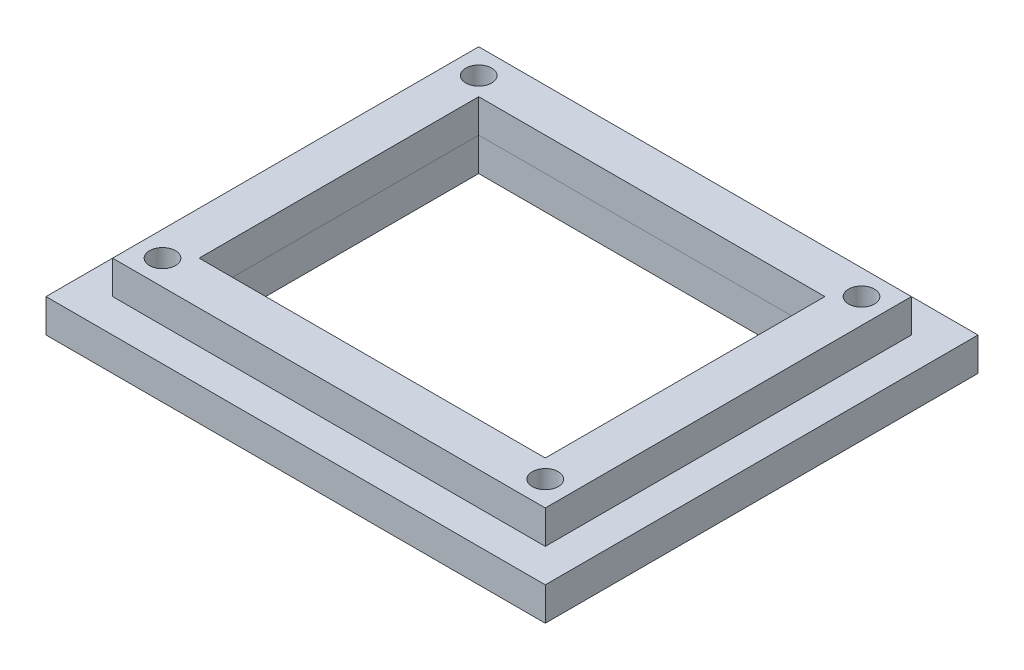
ISO-10303-21;
HEADER;
FILE_DESCRIPTION(('STEP AP214'),'2;1');
FILE_NAME('part.step','',(''),(''),'','','');
FILE_SCHEMA(('AUTOMOTIVE_DESIGN { 1 0 10303 214 1 1 1 1 }'));
ENDSEC;
DATA;
#1=APPLICATION_CONTEXT('core data for automotive mechanical design processes');
#2=APPLICATION_PROTOCOL_DEFINITION('international standard','automotive_design',2000,#1);
#3=PRODUCT_CONTEXT('',#1,'mechanical');
#4=PRODUCT('Part','Part','',(#3));
#5=PRODUCT_RELATED_PRODUCT_CATEGORY('part','',(#4));
#6=PRODUCT_DEFINITION_FORMATION('','',#4);
#7=PRODUCT_DEFINITION_CONTEXT('part definition',#1,'design');
#8=PRODUCT_DEFINITION('design','',#6,#7);
#9=PRODUCT_DEFINITION_SHAPE('','',#8);
#10=(LENGTH_UNIT() NAMED_UNIT(*) SI_UNIT(.MILLI.,.METRE.));
#11=(NAMED_UNIT(*) PLANE_ANGLE_UNIT() SI_UNIT($,.RADIAN.));
#12=(NAMED_UNIT(*) SI_UNIT($,.STERADIAN.) SOLID_ANGLE_UNIT());
#13=UNCERTAINTY_MEASURE_WITH_UNIT(LENGTH_MEASURE(1.E-05),#10,'distance_accuracy_value','');
#14=(GEOMETRIC_REPRESENTATION_CONTEXT(3) GLOBAL_UNCERTAINTY_ASSIGNED_CONTEXT((#13)) GLOBAL_UNIT_ASSIGNED_CONTEXT((#10,
#11,#12)) REPRESENTATION_CONTEXT('',''));
#15=CARTESIAN_POINT('',(0.,0.,0.));
#16=DIRECTION('',(0.,0.,1.));
#17=DIRECTION('',(1.,0.,0.));
#18=AXIS2_PLACEMENT_3D('',#15,#16,#17);
#19=CARTESIAN_POINT('',(26.,-5.,0.));
#20=DIRECTION('',(1.,0.,0.));
#21=DIRECTION('',(0.,0.,-1.));
#22=AXIS2_PLACEMENT_3D('',#19,#20,#21);
#23=PLANE('',#22);
#24=DIRECTION('',(0.,0.,-1.));
#25=VECTOR('',#24,1.);
#26=CARTESIAN_POINT('',(26.,0.,0.));
#27=LINE('',#26,#25);
#28=CARTESIAN_POINT('',(26.,0.,21.));
#29=VERTEX_POINT('',#28);
#30=CARTESIAN_POINT('',(26.,0.,-21.));
#31=VERTEX_POINT('',#30);
#32=EDGE_CURVE('E245',#29,#31,#27,.T.);
#33=ORIENTED_EDGE('',*,*,#32,.T.);
#34=DIRECTION('',(0.,1.,0.));
#35=VECTOR('',#34,1.);
#36=CARTESIAN_POINT('',(26.,-5.,-21.));
#37=LINE('',#36,#35);
#38=CARTESIAN_POINT('',(26.,-5.,-21.));
#39=VERTEX_POINT('',#38);
#40=EDGE_CURVE('E126',#39,#31,#37,.T.);
#41=ORIENTED_EDGE('',*,*,#40,.F.);
#42=DIRECTION('',(0.,0.,-1.));
#43=VECTOR('',#42,1.);
#44=CARTESIAN_POINT('',(26.,-5.,0.));
#45=LINE('',#44,#43);
#46=CARTESIAN_POINT('',(26.,-5.,21.));
#47=VERTEX_POINT('',#46);
#48=EDGE_CURVE('E196',#47,#39,#45,.T.);
#49=ORIENTED_EDGE('',*,*,#48,.F.);
#50=DIRECTION('',(0.,1.,0.));
#51=VECTOR('',#50,1.);
#52=CARTESIAN_POINT('',(26.,-5.,21.));
#53=LINE('',#52,#51);
#54=EDGE_CURVE('E13',#47,#29,#53,.T.);
#55=ORIENTED_EDGE('',*,*,#54,.T.);
#56=EDGE_LOOP('',(#33,#41,#49,#55));
#57=FACE_BOUND('',#56,.T.);
#58=ADVANCED_FACE('F115',(#57),#23,.F.);
#59=CARTESIAN_POINT('',(0.,-5.,-21.));
#60=DIRECTION('',(0.,0.,-1.));
#61=DIRECTION('',(-1.,0.,0.));
#62=AXIS2_PLACEMENT_3D('',#59,#60,#61);
#63=PLANE('',#62);
#64=DIRECTION('',(-1.,0.,0.));
#65=VECTOR('',#64,1.);
#66=CARTESIAN_POINT('',(0.,0.,-21.));
#67=LINE('',#66,#65);
#68=CARTESIAN_POINT('',(-26.,0.,-21.));
#69=VERTEX_POINT('',#68);
#70=EDGE_CURVE('E163',#31,#69,#67,.T.);
#71=ORIENTED_EDGE('',*,*,#70,.T.);
#72=DIRECTION('',(0.,1.,0.));
#73=VECTOR('',#72,1.);
#74=CARTESIAN_POINT('',(-26.,-5.,-21.));
#75=LINE('',#74,#73);
#76=CARTESIAN_POINT('',(-26.,-5.,-21.));
#77=VERTEX_POINT('',#76);
#78=EDGE_CURVE('E201',#77,#69,#75,.T.);
#79=ORIENTED_EDGE('',*,*,#78,.F.);
#80=DIRECTION('',(-1.,0.,0.));
#81=VECTOR('',#80,1.);
#82=CARTESIAN_POINT('',(0.,-5.,-21.));
#83=LINE('',#82,#81);
#84=EDGE_CURVE('E190',#39,#77,#83,.T.);
#85=ORIENTED_EDGE('',*,*,#84,.F.);
#86=ORIENTED_EDGE('',*,*,#40,.T.);
#87=EDGE_LOOP('',(#71,#79,#85,#86));
#88=FACE_BOUND('',#87,.T.);
#89=ADVANCED_FACE('F202',(#88),#63,.F.);
#90=CARTESIAN_POINT('',(-26.,-5.,0.));
#91=DIRECTION('',(1.,0.,0.));
#92=DIRECTION('',(0.,0.,-1.));
#93=AXIS2_PLACEMENT_3D('',#90,#91,#92);
#94=PLANE('',#93);
#95=DIRECTION('',(0.,0.,-1.));
#96=VECTOR('',#95,1.);
#97=CARTESIAN_POINT('',(-26.,0.,0.));
#98=LINE('',#97,#96);
#99=CARTESIAN_POINT('',(-26.,0.,21.));
#100=VERTEX_POINT('',#99);
#101=EDGE_CURVE('E240',#100,#69,#98,.T.);
#102=ORIENTED_EDGE('',*,*,#101,.F.);
#103=DIRECTION('',(0.,1.,0.));
#104=VECTOR('',#103,1.);
#105=CARTESIAN_POINT('',(-26.,-5.,21.));
#106=LINE('',#105,#104);
#107=CARTESIAN_POINT('',(-26.,-5.,21.));
#108=VERTEX_POINT('',#107);
#109=EDGE_CURVE('E206',#108,#100,#106,.T.);
#110=ORIENTED_EDGE('',*,*,#109,.F.);
#111=DIRECTION('',(0.,0.,-1.));
#112=VECTOR('',#111,1.);
#113=CARTESIAN_POINT('',(-26.,-5.,0.));
#114=LINE('',#113,#112);
#115=EDGE_CURVE('E195',#108,#77,#114,.T.);
#116=ORIENTED_EDGE('',*,*,#115,.T.);
#117=ORIENTED_EDGE('',*,*,#78,.T.);
#118=EDGE_LOOP('',(#102,#110,#116,#117));
#119=FACE_BOUND('',#118,.T.);
#120=ADVANCED_FACE('F208',(#119),#94,.T.);
#121=CARTESIAN_POINT('',(0.,-5.,21.));
#122=DIRECTION('',(0.,0.,-1.));
#123=DIRECTION('',(-1.,0.,0.));
#124=AXIS2_PLACEMENT_3D('',#121,#122,#123);
#125=PLANE('',#124);
#126=DIRECTION('',(-1.,0.,0.));
#127=VECTOR('',#126,1.);
#128=CARTESIAN_POINT('',(0.,0.,21.));
#129=LINE('',#128,#127);
#130=EDGE_CURVE('E236',#29,#100,#129,.T.);
#131=ORIENTED_EDGE('',*,*,#130,.F.);
#132=ORIENTED_EDGE('',*,*,#54,.F.);
#133=DIRECTION('',(-1.,0.,0.));
#134=VECTOR('',#133,1.);
#135=CARTESIAN_POINT('',(0.,-5.,21.));
#136=LINE('',#135,#134);
#137=EDGE_CURVE('E210',#47,#108,#136,.T.);
#138=ORIENTED_EDGE('',*,*,#137,.T.);
#139=ORIENTED_EDGE('',*,*,#109,.T.);
#140=EDGE_LOOP('',(#131,#132,#138,#139));
#141=FACE_BOUND('',#140,.T.);
#142=ADVANCED_FACE('F297',(#141),#125,.T.);
#143=CARTESIAN_POINT('',(-37.5,-5.,0.));
#144=DIRECTION('',(1.,0.,0.));
#145=DIRECTION('',(0.,0.,-1.));
#146=AXIS2_PLACEMENT_3D('',#143,#144,#145);
#147=PLANE('',#146);
#148=DIRECTION('',(0.,0.,-1.));
#149=VECTOR('',#148,1.);
#150=CARTESIAN_POINT('',(-37.5,0.,0.));
#151=LINE('',#150,#149);
#152=CARTESIAN_POINT('',(-37.5,0.,32.5));
#153=VERTEX_POINT('',#152);
#154=CARTESIAN_POINT('',(-37.5,0.,-32.5));
#155=VERTEX_POINT('',#154);
#156=EDGE_CURVE('E232',#153,#155,#151,.T.);
#157=ORIENTED_EDGE('',*,*,#156,.T.);
#158=DIRECTION('',(0.,1.,0.));
#159=VECTOR('',#158,1.);
#160=CARTESIAN_POINT('',(-37.5,-5.,-32.5));
#161=LINE('',#160,#159);
#162=CARTESIAN_POINT('',(-37.5,-5.,-32.5));
#163=VERTEX_POINT('',#162);
#164=EDGE_CURVE('E256',#163,#155,#161,.T.);
#165=ORIENTED_EDGE('',*,*,#164,.F.);
#166=DIRECTION('',(0.,0.,-1.));
#167=VECTOR('',#166,1.);
#168=CARTESIAN_POINT('',(-37.5,-5.,0.));
#169=LINE('',#168,#167);
#170=CARTESIAN_POINT('',(-37.5,-5.,32.5));
#171=VERTEX_POINT('',#170);
#172=EDGE_CURVE('E213',#171,#163,#169,.T.);
#173=ORIENTED_EDGE('',*,*,#172,.F.);
#174=DIRECTION('',(0.,1.,0.));
#175=VECTOR('',#174,1.);
#176=CARTESIAN_POINT('',(-37.5,-5.,32.5));
#177=LINE('',#176,#175);
#178=EDGE_CURVE('E253',#171,#153,#177,.T.);
#179=ORIENTED_EDGE('',*,*,#178,.T.);
#180=EDGE_LOOP('',(#157,#165,#173,#179));
#181=FACE_BOUND('',#180,.T.);
#182=ADVANCED_FACE('F273',(#181),#147,.F.);
#183=CARTESIAN_POINT('',(0.,-5.,-32.5));
#184=DIRECTION('',(0.,0.,1.));
#185=DIRECTION('',(1.,0.,0.));
#186=AXIS2_PLACEMENT_3D('',#183,#184,#185);
#187=PLANE('',#186);
#188=DIRECTION('',(1.,0.,0.));
#189=VECTOR('',#188,1.);
#190=CARTESIAN_POINT('',(0.,0.,-32.5));
#191=LINE('',#190,#189);
#192=CARTESIAN_POINT('',(37.5,0.,-32.5));
#193=VERTEX_POINT('',#192);
#194=EDGE_CURVE('E228',#155,#193,#191,.T.);
#195=ORIENTED_EDGE('',*,*,#194,.T.);
#196=DIRECTION('',(0.,1.,0.));
#197=VECTOR('',#196,1.);
#198=CARTESIAN_POINT('',(37.5,-5.,-32.5));
#199=LINE('',#198,#197);
#200=CARTESIAN_POINT('',(37.5,-5.,-32.5));
#201=VERTEX_POINT('',#200);
#202=EDGE_CURVE('E259',#201,#193,#199,.T.);
#203=ORIENTED_EDGE('',*,*,#202,.F.);
#204=DIRECTION('',(1.,0.,0.));
#205=VECTOR('',#204,1.);
#206=CARTESIAN_POINT('',(0.,-5.,-32.5));
#207=LINE('',#206,#205);
#208=EDGE_CURVE('E278',#163,#201,#207,.T.);
#209=ORIENTED_EDGE('',*,*,#208,.F.);
#210=ORIENTED_EDGE('',*,*,#164,.T.);
#211=EDGE_LOOP('',(#195,#203,#209,#210));
#212=FACE_BOUND('',#211,.T.);
#213=ADVANCED_FACE('F290',(#212),#187,.F.);
#214=CARTESIAN_POINT('',(37.5,-5.,0.));
#215=DIRECTION('',(1.,0.,0.));
#216=DIRECTION('',(0.,0.,-1.));
#217=AXIS2_PLACEMENT_3D('',#214,#215,#216);
#218=PLANE('',#217);
#219=DIRECTION('',(0.,0.,-1.));
#220=VECTOR('',#219,1.);
#221=CARTESIAN_POINT('',(37.5,0.,0.));
#222=LINE('',#221,#220);
#223=CARTESIAN_POINT('',(37.5,0.,32.5));
#224=VERTEX_POINT('',#223);
#225=EDGE_CURVE('E223',#224,#193,#222,.T.);
#226=ORIENTED_EDGE('',*,*,#225,.F.);
#227=DIRECTION('',(0.,1.,0.));
#228=VECTOR('',#227,1.);
#229=CARTESIAN_POINT('',(37.5,-5.,32.5));
#230=LINE('',#229,#228);
#231=CARTESIAN_POINT('',(37.5,-5.,32.5));
#232=VERTEX_POINT('',#231);
#233=EDGE_CURVE('E119',#232,#224,#230,.T.);
#234=ORIENTED_EDGE('',*,*,#233,.F.);
#235=DIRECTION('',(0.,0.,-1.));
#236=VECTOR('',#235,1.);
#237=CARTESIAN_POINT('',(37.5,-5.,0.));
#238=LINE('',#237,#236);
#239=EDGE_CURVE('E279',#232,#201,#238,.T.);
#240=ORIENTED_EDGE('',*,*,#239,.T.);
#241=ORIENTED_EDGE('',*,*,#202,.T.);
#242=EDGE_LOOP('',(#226,#234,#240,#241));
#243=FACE_BOUND('',#242,.T.);
#244=ADVANCED_FACE('F267',(#243),#218,.T.);
#245=CARTESIAN_POINT('',(0.,-5.,32.5));
#246=DIRECTION('',(0.,0.,1.));
#247=DIRECTION('',(1.,0.,0.));
#248=AXIS2_PLACEMENT_3D('',#245,#246,#247);
#249=PLANE('',#248);
#250=DIRECTION('',(1.,0.,0.));
#251=VECTOR('',#250,1.);
#252=CARTESIAN_POINT('',(0.,0.,32.5));
#253=LINE('',#252,#251);
#254=EDGE_CURVE('E219',#153,#224,#253,.T.);
#255=ORIENTED_EDGE('',*,*,#254,.F.);
#256=ORIENTED_EDGE('',*,*,#178,.F.);
#257=DIRECTION('',(1.,0.,0.));
#258=VECTOR('',#257,1.);
#259=CARTESIAN_POINT('',(0.,-5.,32.5));
#260=LINE('',#259,#258);
#261=EDGE_CURVE('E247',#171,#232,#260,.T.);
#262=ORIENTED_EDGE('',*,*,#261,.T.);
#263=ORIENTED_EDGE('',*,*,#233,.T.);
#264=EDGE_LOOP('',(#255,#256,#262,#263));
#265=FACE_BOUND('',#264,.T.);
#266=ADVANCED_FACE('F117',(#265),#249,.T.);
#267=CARTESIAN_POINT('',(0.,0.,0.));
#268=DIRECTION('',(0.,1.,0.));
#269=DIRECTION('',(0.,0.,1.));
#270=AXIS2_PLACEMENT_3D('',#267,#268,#269);
#271=PLANE('',#270);
#272=CARTESIAN_POINT('',(-30.,0.,25.));
#273=DIRECTION('',(0.,-1.,0.));
#274=DIRECTION('',(0.,0.,-1.));
#275=AXIS2_PLACEMENT_3D('',#272,#273,#274);
#276=CIRCLE('',#275,1.95);
#277=CARTESIAN_POINT('',(-30.,0.,23.05));
#278=VERTEX_POINT('',#277);
#279=EDGE_CURVE('E224',#278,#278,#276,.T.);
#280=ORIENTED_EDGE('',*,*,#279,.T.);
#281=EDGE_LOOP('',(#280));
#282=FACE_BOUND('',#281,.T.);
#283=CARTESIAN_POINT('',(-30.,0.,-25.));
#284=DIRECTION('',(0.,-1.,0.));
#285=DIRECTION('',(0.,0.,-1.));
#286=AXIS2_PLACEMENT_3D('',#283,#284,#285);
#287=CIRCLE('',#286,1.95);
#288=CARTESIAN_POINT('',(-30.,0.,-26.95));
#289=VERTEX_POINT('',#288);
#290=EDGE_CURVE('E327',#289,#289,#287,.T.);
#291=ORIENTED_EDGE('',*,*,#290,.T.);
#292=EDGE_LOOP('',(#291));
#293=FACE_BOUND('',#292,.T.);
#294=CARTESIAN_POINT('',(30.,0.,-25.));
#295=DIRECTION('',(0.,-1.,0.));
#296=DIRECTION('',(0.,0.,-1.));
#297=AXIS2_PLACEMENT_3D('',#294,#295,#296);
#298=CIRCLE('',#297,1.95);
#299=CARTESIAN_POINT('',(30.,0.,-26.95));
#300=VERTEX_POINT('',#299);
#301=EDGE_CURVE('E331',#300,#300,#298,.T.);
#302=ORIENTED_EDGE('',*,*,#301,.T.);
#303=EDGE_LOOP('',(#302));
#304=FACE_BOUND('',#303,.T.);
#305=CARTESIAN_POINT('',(30.,0.,25.));
#306=DIRECTION('',(0.,-1.,0.));
#307=DIRECTION('',(0.,0.,-1.));
#308=AXIS2_PLACEMENT_3D('',#305,#306,#307);
#309=CIRCLE('',#308,1.95);
#310=CARTESIAN_POINT('',(30.,0.,23.05));
#311=VERTEX_POINT('',#310);
#312=EDGE_CURVE('E285',#311,#311,#309,.T.);
#313=ORIENTED_EDGE('',*,*,#312,.T.);
#314=EDGE_LOOP('',(#313));
#315=FACE_BOUND('',#314,.T.);
#316=ORIENTED_EDGE('',*,*,#254,.T.);
#317=ORIENTED_EDGE('',*,*,#225,.T.);
#318=ORIENTED_EDGE('',*,*,#194,.F.);
#319=ORIENTED_EDGE('',*,*,#156,.F.);
#320=EDGE_LOOP('',(#316,#317,#318,#319));
#321=FACE_BOUND('',#320,.T.);
#322=ORIENTED_EDGE('',*,*,#130,.T.);
#323=ORIENTED_EDGE('',*,*,#101,.T.);
#324=ORIENTED_EDGE('',*,*,#70,.F.);
#325=ORIENTED_EDGE('',*,*,#32,.F.);
#326=EDGE_LOOP('',(#322,#323,#324,#325));
#327=FACE_BOUND('',#326,.T.);
#328=ADVANCED_FACE('F270',(#282,#293,#304,#315,#321,#327),#271,.T.);
#329=CARTESIAN_POINT('',(0.,-5.,0.));
#330=DIRECTION('',(0.,1.,0.));
#331=DIRECTION('',(0.,0.,1.));
#332=AXIS2_PLACEMENT_3D('',#329,#330,#331);
#333=PLANE('',#332);
#334=CARTESIAN_POINT('',(-30.,-5.,25.));
#335=DIRECTION('',(0.,-1.,0.));
#336=DIRECTION('',(0.,0.,-1.));
#337=AXIS2_PLACEMENT_3D('',#334,#335,#336);
#338=CIRCLE('',#337,1.95);
#339=CARTESIAN_POINT('',(-30.,-5.,23.05));
#340=VERTEX_POINT('',#339);
#341=EDGE_CURVE('E354',#340,#340,#338,.T.);
#342=ORIENTED_EDGE('',*,*,#341,.F.);
#343=EDGE_LOOP('',(#342));
#344=FACE_BOUND('',#343,.T.);
#345=CARTESIAN_POINT('',(-30.,-5.,-25.));
#346=DIRECTION('',(0.,-1.,0.));
#347=DIRECTION('',(0.,0.,-1.));
#348=AXIS2_PLACEMENT_3D('',#345,#346,#347);
#349=CIRCLE('',#348,1.95);
#350=CARTESIAN_POINT('',(-30.,-5.,-26.95));
#351=VERTEX_POINT('',#350);
#352=EDGE_CURVE('E350',#351,#351,#349,.T.);
#353=ORIENTED_EDGE('',*,*,#352,.F.);
#354=EDGE_LOOP('',(#353));
#355=FACE_BOUND('',#354,.T.);
#356=CARTESIAN_POINT('',(30.,-5.,-25.));
#357=DIRECTION('',(0.,-1.,0.));
#358=DIRECTION('',(0.,0.,-1.));
#359=AXIS2_PLACEMENT_3D('',#356,#357,#358);
#360=CIRCLE('',#359,1.95);
#361=CARTESIAN_POINT('',(30.,-5.,-26.95));
#362=VERTEX_POINT('',#361);
#363=EDGE_CURVE('E342',#362,#362,#360,.T.);
#364=ORIENTED_EDGE('',*,*,#363,.F.);
#365=EDGE_LOOP('',(#364));
#366=FACE_BOUND('',#365,.T.);
#367=CARTESIAN_POINT('',(30.,-5.,25.));
#368=DIRECTION('',(0.,-1.,0.));
#369=DIRECTION('',(0.,0.,-1.));
#370=AXIS2_PLACEMENT_3D('',#367,#368,#369);
#371=CIRCLE('',#370,1.95);
#372=CARTESIAN_POINT('',(30.,-5.,23.05));
#373=VERTEX_POINT('',#372);
#374=EDGE_CURVE('E336',#373,#373,#371,.T.);
#375=ORIENTED_EDGE('',*,*,#374,.F.);
#376=EDGE_LOOP('',(#375));
#377=FACE_BOUND('',#376,.T.);
#378=ORIENTED_EDGE('',*,*,#261,.F.);
#379=ORIENTED_EDGE('',*,*,#172,.T.);
#380=ORIENTED_EDGE('',*,*,#208,.T.);
#381=ORIENTED_EDGE('',*,*,#239,.F.);
#382=EDGE_LOOP('',(#378,#379,#380,#381));
#383=FACE_BOUND('',#382,.T.);
#384=ORIENTED_EDGE('',*,*,#137,.F.);
#385=ORIENTED_EDGE('',*,*,#48,.T.);
#386=ORIENTED_EDGE('',*,*,#84,.T.);
#387=ORIENTED_EDGE('',*,*,#115,.F.);
#388=EDGE_LOOP('',(#384,#385,#386,#387));
#389=FACE_BOUND('',#388,.T.);
#390=ADVANCED_FACE('F193',(#344,#355,#366,#377,#383,#389),#333,.F.);
#391=CARTESIAN_POINT('',(30.,0.,25.));
#392=DIRECTION('',(0.,-1.,0.));
#393=DIRECTION('',(0.,0.,-1.));
#394=AXIS2_PLACEMENT_3D('',#391,#392,#393);
#395=CYLINDRICAL_SURFACE('',#394,1.95);
#396=ORIENTED_EDGE('',*,*,#312,.F.);
#397=EDGE_LOOP('',(#396));
#398=FACE_BOUND('',#397,.T.);
#399=ORIENTED_EDGE('',*,*,#374,.T.);
#400=EDGE_LOOP('',(#399));
#401=FACE_BOUND('',#400,.T.);
#402=ADVANCED_FACE('F319',(#398,#401),#395,.F.);
#403=CARTESIAN_POINT('',(30.,0.,-25.));
#404=DIRECTION('',(0.,-1.,0.));
#405=DIRECTION('',(0.,0.,-1.));
#406=AXIS2_PLACEMENT_3D('',#403,#404,#405);
#407=CYLINDRICAL_SURFACE('',#406,1.95);
#408=ORIENTED_EDGE('',*,*,#301,.F.);
#409=EDGE_LOOP('',(#408));
#410=FACE_BOUND('',#409,.T.);
#411=ORIENTED_EDGE('',*,*,#363,.T.);
#412=EDGE_LOOP('',(#411));
#413=FACE_BOUND('',#412,.T.);
#414=ADVANCED_FACE('F368',(#410,#413),#407,.F.);
#415=CARTESIAN_POINT('',(-30.,0.,-25.));
#416=DIRECTION('',(0.,-1.,0.));
#417=DIRECTION('',(0.,0.,-1.));
#418=AXIS2_PLACEMENT_3D('',#415,#416,#417);
#419=CYLINDRICAL_SURFACE('',#418,1.95);
#420=ORIENTED_EDGE('',*,*,#290,.F.);
#421=EDGE_LOOP('',(#420));
#422=FACE_BOUND('',#421,.T.);
#423=ORIENTED_EDGE('',*,*,#352,.T.);
#424=EDGE_LOOP('',(#423));
#425=FACE_BOUND('',#424,.T.);
#426=ADVANCED_FACE('F370',(#422,#425),#419,.F.);
#427=CARTESIAN_POINT('',(-30.,0.,25.));
#428=DIRECTION('',(0.,-1.,0.));
#429=DIRECTION('',(0.,0.,-1.));
#430=AXIS2_PLACEMENT_3D('',#427,#428,#429);
#431=CYLINDRICAL_SURFACE('',#430,1.95);
#432=ORIENTED_EDGE('',*,*,#279,.F.);
#433=EDGE_LOOP('',(#432));
#434=FACE_BOUND('',#433,.T.);
#435=ORIENTED_EDGE('',*,*,#341,.T.);
#436=EDGE_LOOP('',(#435));
#437=FACE_BOUND('',#436,.T.);
#438=ADVANCED_FACE('F361',(#434,#437),#431,.F.);
#439=CLOSED_SHELL('',(#58,#89,#120,#142,#182,#213,#244,#266,#328,#390,#402,#414,#426,#438));
#440=MANIFOLD_SOLID_BREP('B2',#439);
#441=CARTESIAN_POINT('',(0.,5.,21.));
#442=DIRECTION('',(0.,0.,1.));
#443=DIRECTION('',(1.,0.,0.));
#444=AXIS2_PLACEMENT_3D('',#441,#442,#443);
#445=PLANE('',#444);
#446=DIRECTION('',(-1.,0.,0.));
#447=VECTOR('',#446,1.);
#448=CARTESIAN_POINT('',(0.,0.,21.));
#449=LINE('',#448,#447);
#450=CARTESIAN_POINT('',(26.,0.,21.));
#451=VERTEX_POINT('',#450);
#452=CARTESIAN_POINT('',(-26.,0.,21.));
#453=VERTEX_POINT('',#452);
#454=EDGE_CURVE('E644',#451,#453,#449,.T.);
#455=ORIENTED_EDGE('',*,*,#454,.T.);
#456=DIRECTION('',(0.,-1.,0.));
#457=VECTOR('',#456,1.);
#458=CARTESIAN_POINT('',(-26.,5.,21.));
#459=LINE('',#458,#457);
#460=CARTESIAN_POINT('',(-26.,5.,21.));
#461=VERTEX_POINT('',#460);
#462=EDGE_CURVE('E113',#461,#453,#459,.T.);
#463=ORIENTED_EDGE('',*,*,#462,.F.);
#464=DIRECTION('',(-1.,0.,0.));
#465=VECTOR('',#464,1.);
#466=CARTESIAN_POINT('',(0.,5.,21.));
#467=LINE('',#466,#465);
#468=CARTESIAN_POINT('',(26.,5.,21.));
#469=VERTEX_POINT('',#468);
#470=EDGE_CURVE('E603',#469,#461,#467,.T.);
#471=ORIENTED_EDGE('',*,*,#470,.F.);
#472=DIRECTION('',(0.,-1.,0.));
#473=VECTOR('',#472,1.);
#474=CARTESIAN_POINT('',(26.,5.,21.));
#475=LINE('',#474,#473);
#476=EDGE_CURVE('E543',#469,#451,#475,.T.);
#477=ORIENTED_EDGE('',*,*,#476,.T.);
#478=EDGE_LOOP('',(#455,#463,#471,#477));
#479=FACE_BOUND('',#478,.T.);
#480=ADVANCED_FACE('F524',(#479),#445,.F.);
#481=CARTESIAN_POINT('',(-26.,5.,0.));
#482=DIRECTION('',(-1.,0.,0.));
#483=DIRECTION('',(0.,0.,1.));
#484=AXIS2_PLACEMENT_3D('',#481,#482,#483);
#485=PLANE('',#484);
#486=DIRECTION('',(0.,0.,-1.));
#487=VECTOR('',#486,1.);
#488=CARTESIAN_POINT('',(-26.,0.,0.));
#489=LINE('',#488,#487);
#490=CARTESIAN_POINT('',(-26.,0.,-21.));
#491=VERTEX_POINT('',#490);
#492=EDGE_CURVE('E609',#453,#491,#489,.T.);
#493=ORIENTED_EDGE('',*,*,#492,.T.);
#494=DIRECTION('',(0.,-1.,0.));
#495=VECTOR('',#494,1.);
#496=CARTESIAN_POINT('',(-26.,5.,-21.));
#497=LINE('',#496,#495);
#498=CARTESIAN_POINT('',(-26.,5.,-21.));
#499=VERTEX_POINT('',#498);
#500=EDGE_CURVE('E534',#499,#491,#497,.T.);
#501=ORIENTED_EDGE('',*,*,#500,.F.);
#502=DIRECTION('',(0.,0.,-1.));
#503=VECTOR('',#502,1.);
#504=CARTESIAN_POINT('',(-26.,5.,0.));
#505=LINE('',#504,#503);
#506=EDGE_CURVE('E597',#461,#499,#505,.T.);
#507=ORIENTED_EDGE('',*,*,#506,.F.);
#508=ORIENTED_EDGE('',*,*,#462,.T.);
#509=EDGE_LOOP('',(#493,#501,#507,#508));
#510=FACE_BOUND('',#509,.T.);
#511=ADVANCED_FACE('F608',(#510),#485,.F.);
#512=CARTESIAN_POINT('',(0.,5.,-21.));
#513=DIRECTION('',(0.,0.,1.));
#514=DIRECTION('',(1.,0.,0.));
#515=AXIS2_PLACEMENT_3D('',#512,#513,#514);
#516=PLANE('',#515);
#517=DIRECTION('',(-1.,0.,0.));
#518=VECTOR('',#517,1.);
#519=CARTESIAN_POINT('',(0.,0.,-21.));
#520=LINE('',#519,#518);
#521=CARTESIAN_POINT('',(26.,0.,-21.));
#522=VERTEX_POINT('',#521);
#523=EDGE_CURVE('E647',#522,#491,#520,.T.);
#524=ORIENTED_EDGE('',*,*,#523,.F.);
#525=DIRECTION('',(0.,-1.,0.));
#526=VECTOR('',#525,1.);
#527=CARTESIAN_POINT('',(26.,5.,-21.));
#528=LINE('',#527,#526);
#529=CARTESIAN_POINT('',(26.,5.,-21.));
#530=VERTEX_POINT('',#529);
#531=EDGE_CURVE('E569',#530,#522,#528,.T.);
#532=ORIENTED_EDGE('',*,*,#531,.F.);
#533=DIRECTION('',(-1.,0.,0.));
#534=VECTOR('',#533,1.);
#535=CARTESIAN_POINT('',(0.,5.,-21.));
#536=LINE('',#535,#534);
#537=EDGE_CURVE('E602',#530,#499,#536,.T.);
#538=ORIENTED_EDGE('',*,*,#537,.T.);
#539=ORIENTED_EDGE('',*,*,#500,.T.);
#540=EDGE_LOOP('',(#524,#532,#538,#539));
#541=FACE_BOUND('',#540,.T.);
#542=ADVANCED_FACE('F613',(#541),#516,.T.);
#543=CARTESIAN_POINT('',(32.5,5.,0.));
#544=DIRECTION('',(1.,0.,0.));
#545=DIRECTION('',(0.,0.,-1.));
#546=AXIS2_PLACEMENT_3D('',#543,#544,#545);
#547=PLANE('',#546);
#548=DIRECTION('',(0.,0.,1.));
#549=VECTOR('',#548,1.);
#550=CARTESIAN_POINT('',(32.5,0.,0.));
#551=LINE('',#550,#549);
#552=CARTESIAN_POINT('',(32.5,0.,-27.5));
#553=VERTEX_POINT('',#552);
#554=CARTESIAN_POINT('',(32.5,0.,27.5));
#555=VERTEX_POINT('',#554);
#556=EDGE_CURVE('E632',#553,#555,#551,.T.);
#557=ORIENTED_EDGE('',*,*,#556,.F.);
#558=DIRECTION('',(0.,-1.,0.));
#559=VECTOR('',#558,1.);
#560=CARTESIAN_POINT('',(32.5,5.,-27.5));
#561=LINE('',#560,#559);
#562=CARTESIAN_POINT('',(32.5,5.,-27.5));
#563=VERTEX_POINT('',#562);
#564=EDGE_CURVE('E528',#563,#553,#561,.T.);
#565=ORIENTED_EDGE('',*,*,#564,.F.);
#566=DIRECTION('',(0.,0.,1.));
#567=VECTOR('',#566,1.);
#568=CARTESIAN_POINT('',(32.5,5.,0.));
#569=LINE('',#568,#567);
#570=CARTESIAN_POINT('',(32.5,5.,27.5));
#571=VERTEX_POINT('',#570);
#572=EDGE_CURVE('E683',#563,#571,#569,.T.);
#573=ORIENTED_EDGE('',*,*,#572,.T.);
#574=DIRECTION('',(0.,-1.,0.));
#575=VECTOR('',#574,1.);
#576=CARTESIAN_POINT('',(32.5,5.,27.5));
#577=LINE('',#576,#575);
#578=EDGE_CURVE('E616',#571,#555,#577,.T.);
#579=ORIENTED_EDGE('',*,*,#578,.T.);
#580=EDGE_LOOP('',(#557,#565,#573,#579));
#581=FACE_BOUND('',#580,.T.);
#582=ADVANCED_FACE('F668',(#581),#547,.T.);
#583=CARTESIAN_POINT('',(0.,5.,-27.5));
#584=DIRECTION('',(0.,0.,-1.));
#585=DIRECTION('',(-1.,0.,0.));
#586=AXIS2_PLACEMENT_3D('',#583,#584,#585);
#587=PLANE('',#586);
#588=DIRECTION('',(1.,0.,0.));
#589=VECTOR('',#588,1.);
#590=CARTESIAN_POINT('',(0.,0.,-27.5));
#591=LINE('',#590,#589);
#592=CARTESIAN_POINT('',(-32.5,0.,-27.5));
#593=VERTEX_POINT('',#592);
#594=EDGE_CURVE('E635',#593,#553,#591,.T.);
#595=ORIENTED_EDGE('',*,*,#594,.F.);
#596=DIRECTION('',(0.,-1.,0.));
#597=VECTOR('',#596,1.);
#598=CARTESIAN_POINT('',(-32.5,5.,-27.5));
#599=LINE('',#598,#597);
#600=CARTESIAN_POINT('',(-32.5,5.,-27.5));
#601=VERTEX_POINT('',#600);
#602=EDGE_CURVE('E658',#601,#593,#599,.T.);
#603=ORIENTED_EDGE('',*,*,#602,.F.);
#604=DIRECTION('',(1.,0.,0.));
#605=VECTOR('',#604,1.);
#606=CARTESIAN_POINT('',(0.,5.,-27.5));
#607=LINE('',#606,#605);
#608=EDGE_CURVE('E667',#601,#563,#607,.T.);
#609=ORIENTED_EDGE('',*,*,#608,.T.);
#610=ORIENTED_EDGE('',*,*,#564,.T.);
#611=EDGE_LOOP('',(#595,#603,#609,#610));
#612=FACE_BOUND('',#611,.T.);
#613=ADVANCED_FACE('F665',(#612),#587,.T.);
#614=CARTESIAN_POINT('',(-32.5,5.,0.));
#615=DIRECTION('',(1.,0.,0.));
#616=DIRECTION('',(0.,0.,-1.));
#617=AXIS2_PLACEMENT_3D('',#614,#615,#616);
#618=PLANE('',#617);
#619=DIRECTION('',(0.,0.,1.));
#620=VECTOR('',#619,1.);
#621=CARTESIAN_POINT('',(-32.5,0.,0.));
#622=LINE('',#621,#620);
#623=CARTESIAN_POINT('',(-32.5,0.,27.5));
#624=VERTEX_POINT('',#623);
#625=EDGE_CURVE('E638',#593,#624,#622,.T.);
#626=ORIENTED_EDGE('',*,*,#625,.T.);
#627=DIRECTION('',(0.,-1.,0.));
#628=VECTOR('',#627,1.);
#629=CARTESIAN_POINT('',(-32.5,5.,27.5));
#630=LINE('',#629,#628);
#631=CARTESIAN_POINT('',(-32.5,5.,27.5));
#632=VERTEX_POINT('',#631);
#633=EDGE_CURVE('E656',#632,#624,#630,.T.);
#634=ORIENTED_EDGE('',*,*,#633,.F.);
#635=DIRECTION('',(0.,0.,1.));
#636=VECTOR('',#635,1.);
#637=CARTESIAN_POINT('',(-32.5,5.,0.));
#638=LINE('',#637,#636);
#639=EDGE_CURVE('E676',#601,#632,#638,.T.);
#640=ORIENTED_EDGE('',*,*,#639,.F.);
#641=ORIENTED_EDGE('',*,*,#602,.T.);
#642=EDGE_LOOP('',(#626,#634,#640,#641));
#643=FACE_BOUND('',#642,.T.);
#644=ADVANCED_FACE('F674',(#643),#618,.F.);
#645=CARTESIAN_POINT('',(0.,5.,27.5));
#646=DIRECTION('',(0.,0.,-1.));
#647=DIRECTION('',(-1.,0.,0.));
#648=AXIS2_PLACEMENT_3D('',#645,#646,#647);
#649=PLANE('',#648);
#650=DIRECTION('',(1.,0.,0.));
#651=VECTOR('',#650,1.);
#652=CARTESIAN_POINT('',(0.,0.,27.5));
#653=LINE('',#652,#651);
#654=EDGE_CURVE('E641',#624,#555,#653,.T.);
#655=ORIENTED_EDGE('',*,*,#654,.T.);
#656=ORIENTED_EDGE('',*,*,#578,.F.);
#657=DIRECTION('',(1.,0.,0.));
#658=VECTOR('',#657,1.);
#659=CARTESIAN_POINT('',(0.,5.,27.5));
#660=LINE('',#659,#658);
#661=EDGE_CURVE('E679',#632,#571,#660,.T.);
#662=ORIENTED_EDGE('',*,*,#661,.F.);
#663=ORIENTED_EDGE('',*,*,#633,.T.);
#664=EDGE_LOOP('',(#655,#656,#662,#663));
#665=FACE_BOUND('',#664,.T.);
#666=ADVANCED_FACE('F678',(#665),#649,.F.);
#667=CARTESIAN_POINT('',(-28.75,5.,23.75));
#668=DIRECTION('',(0.,-1.,0.));
#669=DIRECTION('',(0.,0.,-1.));
#670=AXIS2_PLACEMENT_3D('',#667,#668,#669);
#671=CYLINDRICAL_SURFACE('',#670,1.95);
#672=CARTESIAN_POINT('',(-28.75,5.,23.75));
#673=DIRECTION('',(0.,1.,0.));
#674=DIRECTION('',(0.,0.,1.));
#675=AXIS2_PLACEMENT_3D('',#672,#673,#674);
#676=CIRCLE('',#675,1.95);
#677=CARTESIAN_POINT('',(-28.75,5.,25.7));
#678=VERTEX_POINT('',#677);
#679=EDGE_CURVE('E687',#678,#678,#676,.T.);
#680=ORIENTED_EDGE('',*,*,#679,.T.);
#681=EDGE_LOOP('',(#680));
#682=FACE_BOUND('',#681,.T.);
#683=CARTESIAN_POINT('',(-28.75,0.,23.75));
#684=DIRECTION('',(0.,1.,0.));
#685=DIRECTION('',(0.,0.,1.));
#686=AXIS2_PLACEMENT_3D('',#683,#684,#685);
#687=CIRCLE('',#686,1.95);
#688=CARTESIAN_POINT('',(-28.75,0.,25.7));
#689=VERTEX_POINT('',#688);
#690=EDGE_CURVE('E629',#689,#689,#687,.T.);
#691=ORIENTED_EDGE('',*,*,#690,.F.);
#692=EDGE_LOOP('',(#691));
#693=FACE_BOUND('',#692,.T.);
#694=ADVANCED_FACE('F711',(#682,#693),#671,.F.);
#695=CARTESIAN_POINT('',(28.75,5.,-23.75));
#696=DIRECTION('',(0.,-1.,0.));
#697=DIRECTION('',(0.,0.,-1.));
#698=AXIS2_PLACEMENT_3D('',#695,#696,#697);
#699=CYLINDRICAL_SURFACE('',#698,1.95);
#700=CARTESIAN_POINT('',(28.75,5.,-23.75));
#701=DIRECTION('',(0.,1.,0.));
#702=DIRECTION('',(0.,0.,1.));
#703=AXIS2_PLACEMENT_3D('',#700,#701,#702);
#704=CIRCLE('',#703,1.95);
#705=CARTESIAN_POINT('',(28.75,5.,-21.8));
#706=VERTEX_POINT('',#705);
#707=EDGE_CURVE('E690',#706,#706,#704,.T.);
#708=ORIENTED_EDGE('',*,*,#707,.T.);
#709=EDGE_LOOP('',(#708));
#710=FACE_BOUND('',#709,.T.);
#711=CARTESIAN_POINT('',(28.75,0.,-23.75));
#712=DIRECTION('',(0.,1.,0.));
#713=DIRECTION('',(0.,0.,1.));
#714=AXIS2_PLACEMENT_3D('',#711,#712,#713);
#715=CIRCLE('',#714,1.95);
#716=CARTESIAN_POINT('',(28.75,0.,-21.8));
#717=VERTEX_POINT('',#716);
#718=EDGE_CURVE('E626',#717,#717,#715,.T.);
#719=ORIENTED_EDGE('',*,*,#718,.F.);
#720=EDGE_LOOP('',(#719));
#721=FACE_BOUND('',#720,.T.);
#722=ADVANCED_FACE('F714',(#710,#721),#699,.F.);
#723=CARTESIAN_POINT('',(-28.75,5.,-23.75));
#724=DIRECTION('',(0.,-1.,0.));
#725=DIRECTION('',(0.,0.,-1.));
#726=AXIS2_PLACEMENT_3D('',#723,#724,#725);
#727=CYLINDRICAL_SURFACE('',#726,1.95);
#728=CARTESIAN_POINT('',(-28.75,5.,-23.75));
#729=DIRECTION('',(0.,1.,0.));
#730=DIRECTION('',(0.,0.,1.));
#731=AXIS2_PLACEMENT_3D('',#728,#729,#730);
#732=CIRCLE('',#731,1.95);
#733=CARTESIAN_POINT('',(-28.75,5.,-21.8));
#734=VERTEX_POINT('',#733);
#735=EDGE_CURVE('E693',#734,#734,#732,.T.);
#736=ORIENTED_EDGE('',*,*,#735,.T.);
#737=EDGE_LOOP('',(#736));
#738=FACE_BOUND('',#737,.T.);
#739=CARTESIAN_POINT('',(-28.75,0.,-23.75));
#740=DIRECTION('',(0.,1.,0.));
#741=DIRECTION('',(0.,0.,1.));
#742=AXIS2_PLACEMENT_3D('',#739,#740,#741);
#743=CIRCLE('',#742,1.95);
#744=CARTESIAN_POINT('',(-28.75,0.,-21.8));
#745=VERTEX_POINT('',#744);
#746=EDGE_CURVE('E623',#745,#745,#743,.T.);
#747=ORIENTED_EDGE('',*,*,#746,.F.);
#748=EDGE_LOOP('',(#747));
#749=FACE_BOUND('',#748,.T.);
#750=ADVANCED_FACE('F727',(#738,#749),#727,.F.);
#751=CARTESIAN_POINT('',(28.75,5.,23.75));
#752=DIRECTION('',(0.,-1.,0.));
#753=DIRECTION('',(0.,0.,-1.));
#754=AXIS2_PLACEMENT_3D('',#751,#752,#753);
#755=CYLINDRICAL_SURFACE('',#754,1.95);
#756=CARTESIAN_POINT('',(28.75,5.,23.75));
#757=DIRECTION('',(0.,1.,0.));
#758=DIRECTION('',(0.,0.,1.));
#759=AXIS2_PLACEMENT_3D('',#756,#757,#758);
#760=CIRCLE('',#759,1.95);
#761=CARTESIAN_POINT('',(28.75,5.,25.7));
#762=VERTEX_POINT('',#761);
#763=EDGE_CURVE('E652',#762,#762,#760,.T.);
#764=ORIENTED_EDGE('',*,*,#763,.T.);
#765=EDGE_LOOP('',(#764));
#766=FACE_BOUND('',#765,.T.);
#767=CARTESIAN_POINT('',(28.75,0.,23.75));
#768=DIRECTION('',(0.,1.,0.));
#769=DIRECTION('',(0.,0.,1.));
#770=AXIS2_PLACEMENT_3D('',#767,#768,#769);
#771=CIRCLE('',#770,1.95);
#772=CARTESIAN_POINT('',(28.75,0.,25.7));
#773=VERTEX_POINT('',#772);
#774=EDGE_CURVE('E620',#773,#773,#771,.T.);
#775=ORIENTED_EDGE('',*,*,#774,.F.);
#776=EDGE_LOOP('',(#775));
#777=FACE_BOUND('',#776,.T.);
#778=ADVANCED_FACE('F526',(#766,#777),#755,.F.);
#779=CARTESIAN_POINT('',(26.,5.,0.));
#780=DIRECTION('',(-1.,0.,0.));
#781=DIRECTION('',(0.,0.,1.));
#782=AXIS2_PLACEMENT_3D('',#779,#780,#781);
#783=PLANE('',#782);
#784=DIRECTION('',(0.,0.,-1.));
#785=VECTOR('',#784,1.);
#786=CARTESIAN_POINT('',(26.,0.,0.));
#787=LINE('',#786,#785);
#788=EDGE_CURVE('E649',#451,#522,#787,.T.);
#789=ORIENTED_EDGE('',*,*,#788,.F.);
#790=ORIENTED_EDGE('',*,*,#476,.F.);
#791=DIRECTION('',(0.,0.,-1.));
#792=VECTOR('',#791,1.);
#793=CARTESIAN_POINT('',(26.,5.,0.));
#794=LINE('',#793,#792);
#795=EDGE_CURVE('E614',#469,#530,#794,.T.);
#796=ORIENTED_EDGE('',*,*,#795,.T.);
#797=ORIENTED_EDGE('',*,*,#531,.T.);
#798=EDGE_LOOP('',(#789,#790,#796,#797));
#799=FACE_BOUND('',#798,.T.);
#800=ADVANCED_FACE('F703',(#799),#783,.T.);
#801=CARTESIAN_POINT('',(0.,5.,0.));
#802=DIRECTION('',(0.,1.,0.));
#803=DIRECTION('',(0.,0.,1.));
#804=AXIS2_PLACEMENT_3D('',#801,#802,#803);
#805=PLANE('',#804);
#806=ORIENTED_EDGE('',*,*,#763,.F.);
#807=EDGE_LOOP('',(#806));
#808=FACE_BOUND('',#807,.T.);
#809=ORIENTED_EDGE('',*,*,#735,.F.);
#810=EDGE_LOOP('',(#809));
#811=FACE_BOUND('',#810,.T.);
#812=ORIENTED_EDGE('',*,*,#707,.F.);
#813=EDGE_LOOP('',(#812));
#814=FACE_BOUND('',#813,.T.);
#815=ORIENTED_EDGE('',*,*,#679,.F.);
#816=EDGE_LOOP('',(#815));
#817=FACE_BOUND('',#816,.T.);
#818=ORIENTED_EDGE('',*,*,#572,.F.);
#819=ORIENTED_EDGE('',*,*,#608,.F.);
#820=ORIENTED_EDGE('',*,*,#639,.T.);
#821=ORIENTED_EDGE('',*,*,#661,.T.);
#822=EDGE_LOOP('',(#818,#819,#820,#821));
#823=FACE_BOUND('',#822,.T.);
#824=ORIENTED_EDGE('',*,*,#470,.T.);
#825=ORIENTED_EDGE('',*,*,#506,.T.);
#826=ORIENTED_EDGE('',*,*,#537,.F.);
#827=ORIENTED_EDGE('',*,*,#795,.F.);
#828=EDGE_LOOP('',(#824,#825,#826,#827));
#829=FACE_BOUND('',#828,.T.);
#830=ADVANCED_FACE('F599',(#808,#811,#814,#817,#823,#829),#805,.T.);
#831=CARTESIAN_POINT('',(0.,0.,0.));
#832=DIRECTION('',(0.,1.,0.));
#833=DIRECTION('',(0.,0.,1.));
#834=AXIS2_PLACEMENT_3D('',#831,#832,#833);
#835=PLANE('',#834);
#836=ORIENTED_EDGE('',*,*,#690,.T.);
#837=EDGE_LOOP('',(#836));
#838=FACE_BOUND('',#837,.T.);
#839=ORIENTED_EDGE('',*,*,#746,.T.);
#840=EDGE_LOOP('',(#839));
#841=FACE_BOUND('',#840,.T.);
#842=ORIENTED_EDGE('',*,*,#718,.T.);
#843=EDGE_LOOP('',(#842));
#844=FACE_BOUND('',#843,.T.);
#845=ORIENTED_EDGE('',*,*,#774,.T.);
#846=EDGE_LOOP('',(#845));
#847=FACE_BOUND('',#846,.T.);
#848=ORIENTED_EDGE('',*,*,#556,.T.);
#849=ORIENTED_EDGE('',*,*,#654,.F.);
#850=ORIENTED_EDGE('',*,*,#625,.F.);
#851=ORIENTED_EDGE('',*,*,#594,.T.);
#852=EDGE_LOOP('',(#848,#849,#850,#851));
#853=FACE_BOUND('',#852,.T.);
#854=ORIENTED_EDGE('',*,*,#454,.F.);
#855=ORIENTED_EDGE('',*,*,#788,.T.);
#856=ORIENTED_EDGE('',*,*,#523,.T.);
#857=ORIENTED_EDGE('',*,*,#492,.F.);
#858=EDGE_LOOP('',(#854,#855,#856,#857));
#859=FACE_BOUND('',#858,.T.);
#860=ADVANCED_FACE('F671',(#838,#841,#844,#847,#853,#859),#835,.F.);
#861=CLOSED_SHELL('',(#480,#511,#542,#582,#613,#644,#666,#694,#722,#750,#778,#800,#830,#860));
#862=MANIFOLD_SOLID_BREP('B7',#861);
#863=ADVANCED_BREP_SHAPE_REPRESENTATION('',(#18,#440,#862),#14);
#864=SHAPE_DEFINITION_REPRESENTATION(#9,#863);
ENDSEC;
END-ISO-10303-21;
